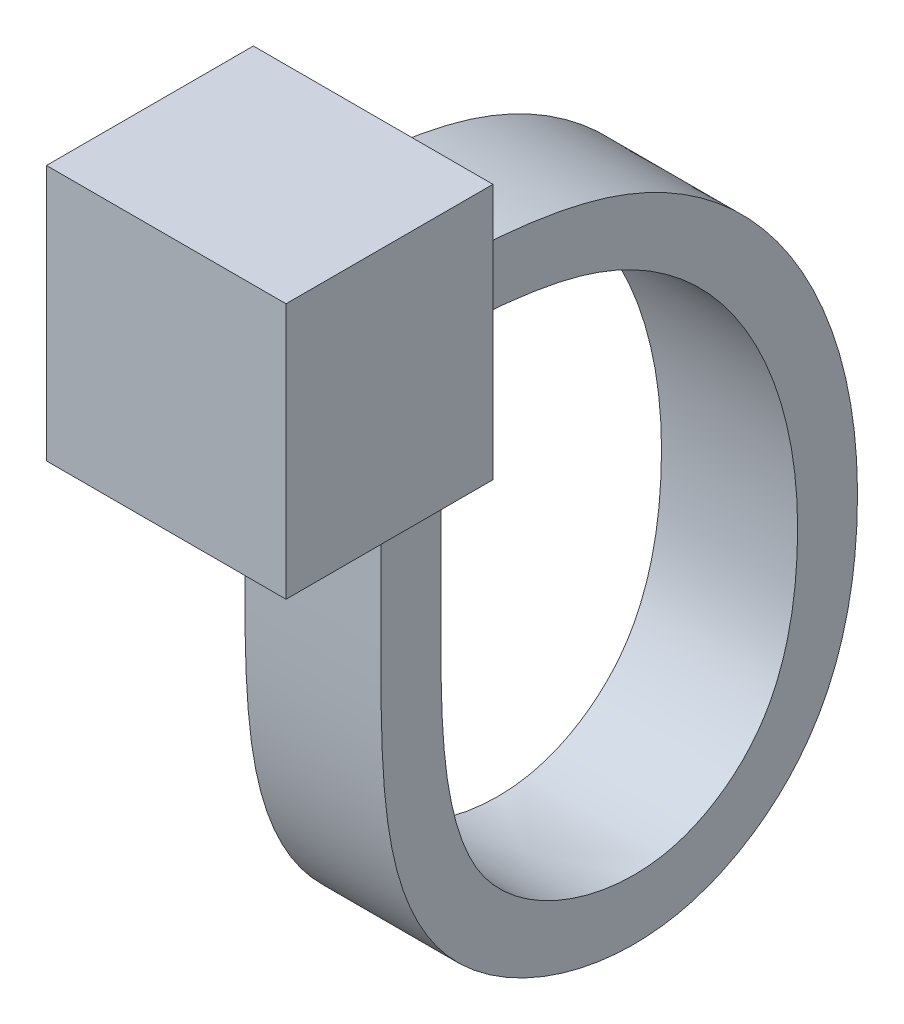
ISO-10303-21;
HEADER;
FILE_DESCRIPTION(('STEP AP214'),'2;1');
FILE_NAME('part.step','',(''),(''),'','','');
FILE_SCHEMA(('AUTOMOTIVE_DESIGN { 1 0 10303 214 1 1 1 1 }'));
ENDSEC;
DATA;
#1=APPLICATION_CONTEXT('core data for automotive mechanical design processes');
#2=APPLICATION_PROTOCOL_DEFINITION('international standard','automotive_design',2000,#1);
#3=PRODUCT_CONTEXT('',#1,'mechanical');
#4=PRODUCT('Part','Part','',(#3));
#5=PRODUCT_RELATED_PRODUCT_CATEGORY('part','',(#4));
#6=PRODUCT_DEFINITION_FORMATION('','',#4);
#7=PRODUCT_DEFINITION_CONTEXT('part definition',#1,'design');
#8=PRODUCT_DEFINITION('design','',#6,#7);
#9=PRODUCT_DEFINITION_SHAPE('','',#8);
#10=(LENGTH_UNIT() NAMED_UNIT(*) SI_UNIT(.MILLI.,.METRE.));
#11=(NAMED_UNIT(*) PLANE_ANGLE_UNIT() SI_UNIT($,.RADIAN.));
#12=(NAMED_UNIT(*) SI_UNIT($,.STERADIAN.) SOLID_ANGLE_UNIT());
#13=UNCERTAINTY_MEASURE_WITH_UNIT(LENGTH_MEASURE(1.E-05),#10,'distance_accuracy_value','');
#14=(GEOMETRIC_REPRESENTATION_CONTEXT(3) GLOBAL_UNCERTAINTY_ASSIGNED_CONTEXT((#13)) GLOBAL_UNIT_ASSIGNED_CONTEXT((#10,
#11,#12)) REPRESENTATION_CONTEXT('',''));
#15=CARTESIAN_POINT('',(0.,0.,0.));
#16=DIRECTION('',(0.,0.,1.));
#17=DIRECTION('',(1.,0.,0.));
#18=AXIS2_PLACEMENT_3D('',#15,#16,#17);
#19=CARTESIAN_POINT('',(0.,-4.7,3.8));
#20=DIRECTION('',(0.,1.,0.));
#21=DIRECTION('',(0.,0.,1.));
#22=AXIS2_PLACEMENT_3D('',#19,#20,#21);
#23=PLANE('',#22);
#24=DIRECTION('',(0.,0.,-1.));
#25=VECTOR('',#24,1.);
#26=CARTESIAN_POINT('',(0.95,-4.7,0.));
#27=LINE('',#26,#25);
#28=CARTESIAN_POINT('',(0.949999999999999,-4.7,1.1));
#29=VERTEX_POINT('',#28);
#30=CARTESIAN_POINT('',(0.95,-4.7,0.));
#31=VERTEX_POINT('',#30);
#32=EDGE_CURVE('E76',#29,#31,#27,.T.);
#33=ORIENTED_EDGE('',*,*,#32,.F.);
#34=DIRECTION('',(-1.,0.,0.));
#35=VECTOR('',#34,1.);
#36=CARTESIAN_POINT('',(0.949999999999999,-4.7,1.1));
#37=LINE('',#36,#35);
#38=CARTESIAN_POINT('',(3.45,-4.7,1.1));
#39=VERTEX_POINT('',#38);
#40=EDGE_CURVE('E71',#39,#29,#37,.T.);
#41=ORIENTED_EDGE('',*,*,#40,.F.);
#42=DIRECTION('',(0.,0.,1.));
#43=VECTOR('',#42,1.);
#44=CARTESIAN_POINT('',(3.45,-4.7,0.));
#45=LINE('',#44,#43);
#46=CARTESIAN_POINT('',(3.45,-4.7,0.));
#47=VERTEX_POINT('',#46);
#48=EDGE_CURVE('E133',#47,#39,#45,.T.);
#49=ORIENTED_EDGE('',*,*,#48,.F.);
#50=DIRECTION('',(1.,0.,0.));
#51=VECTOR('',#50,1.);
#52=CARTESIAN_POINT('',(0.,-4.7,0.));
#53=LINE('',#52,#51);
#54=CARTESIAN_POINT('',(4.4,-4.7,0.));
#55=VERTEX_POINT('',#54);
#56=EDGE_CURVE('E121',#47,#55,#53,.T.);
#57=ORIENTED_EDGE('',*,*,#56,.T.);
#58=DIRECTION('',(0.,0.,-1.));
#59=VECTOR('',#58,1.);
#60=CARTESIAN_POINT('',(4.4,-4.7,3.8));
#61=LINE('',#60,#59);
#62=CARTESIAN_POINT('',(4.4,-4.7,3.8));
#63=VERTEX_POINT('',#62);
#64=EDGE_CURVE('E63',#63,#55,#61,.T.);
#65=ORIENTED_EDGE('',*,*,#64,.F.);
#66=DIRECTION('',(1.,0.,0.));
#67=VECTOR('',#66,1.);
#68=CARTESIAN_POINT('',(0.,-4.7,3.8));
#69=LINE('',#68,#67);
#70=CARTESIAN_POINT('',(0.,-4.7,3.8));
#71=VERTEX_POINT('',#70);
#72=EDGE_CURVE('E194',#71,#63,#69,.T.);
#73=ORIENTED_EDGE('',*,*,#72,.F.);
#74=DIRECTION('',(0.,0.,-1.));
#75=VECTOR('',#74,1.);
#76=CARTESIAN_POINT('',(0.,-4.7,3.8));
#77=LINE('',#76,#75);
#78=CARTESIAN_POINT('',(0.,-4.7,0.));
#79=VERTEX_POINT('',#78);
#80=EDGE_CURVE('E12',#71,#79,#77,.T.);
#81=ORIENTED_EDGE('',*,*,#80,.T.);
#82=EDGE_CURVE('E130',#79,#31,#53,.T.);
#83=ORIENTED_EDGE('',*,*,#82,.T.);
#84=EDGE_LOOP('',(#33,#41,#49,#57,#65,#73,#81,#83));
#85=FACE_BOUND('',#84,.T.);
#86=ADVANCED_FACE('F52',(#85),#23,.F.);
#87=CARTESIAN_POINT('',(0.,0.,3.8));
#88=DIRECTION('',(1.,0.,0.));
#89=DIRECTION('',(0.,1.,0.));
#90=AXIS2_PLACEMENT_3D('',#87,#88,#89);
#91=PLANE('',#90);
#92=DIRECTION('',(0.,-1.,0.));
#93=VECTOR('',#92,1.);
#94=CARTESIAN_POINT('',(0.,0.,0.));
#95=LINE('',#94,#93);
#96=CARTESIAN_POINT('',(0.,0.,0.));
#97=VERTEX_POINT('',#96);
#98=EDGE_CURVE('E131',#97,#79,#95,.T.);
#99=ORIENTED_EDGE('',*,*,#98,.T.);
#100=ORIENTED_EDGE('',*,*,#80,.F.);
#101=DIRECTION('',(0.,-1.,0.));
#102=VECTOR('',#101,1.);
#103=CARTESIAN_POINT('',(0.,0.,3.8));
#104=LINE('',#103,#102);
#105=CARTESIAN_POINT('',(0.,0.,3.8));
#106=VERTEX_POINT('',#105);
#107=EDGE_CURVE('E181',#106,#71,#104,.T.);
#108=ORIENTED_EDGE('',*,*,#107,.F.);
#109=DIRECTION('',(0.,0.,-1.));
#110=VECTOR('',#109,1.);
#111=CARTESIAN_POINT('',(0.,0.,3.8));
#112=LINE('',#111,#110);
#113=EDGE_CURVE('E182',#106,#97,#112,.T.);
#114=ORIENTED_EDGE('',*,*,#113,.T.);
#115=EDGE_LOOP('',(#99,#100,#108,#114));
#116=FACE_BOUND('',#115,.T.);
#117=ADVANCED_FACE('F54',(#116),#91,.F.);
#118=CARTESIAN_POINT('',(4.4,0.,3.8));
#119=DIRECTION('',(-1.,0.,0.));
#120=DIRECTION('',(0.,0.,1.));
#121=AXIS2_PLACEMENT_3D('',#118,#119,#120);
#122=PLANE('',#121);
#123=DIRECTION('',(0.,1.,0.));
#124=VECTOR('',#123,1.);
#125=CARTESIAN_POINT('',(4.4,0.,0.));
#126=LINE('',#125,#124);
#127=CARTESIAN_POINT('',(4.4,0.,0.));
#128=VERTEX_POINT('',#127);
#129=EDGE_CURVE('E127',#55,#128,#126,.T.);
#130=ORIENTED_EDGE('',*,*,#129,.T.);
#131=DIRECTION('',(0.,0.,-1.));
#132=VECTOR('',#131,1.);
#133=CARTESIAN_POINT('',(4.4,0.,3.8));
#134=LINE('',#133,#132);
#135=CARTESIAN_POINT('',(4.4,0.,3.8));
#136=VERTEX_POINT('',#135);
#137=EDGE_CURVE('E185',#136,#128,#134,.T.);
#138=ORIENTED_EDGE('',*,*,#137,.F.);
#139=DIRECTION('',(0.,1.,0.));
#140=VECTOR('',#139,1.);
#141=CARTESIAN_POINT('',(4.4,0.,3.8));
#142=LINE('',#141,#140);
#143=EDGE_CURVE('E193',#63,#136,#142,.T.);
#144=ORIENTED_EDGE('',*,*,#143,.F.);
#145=ORIENTED_EDGE('',*,*,#64,.T.);
#146=EDGE_LOOP('',(#130,#138,#144,#145));
#147=FACE_BOUND('',#146,.T.);
#148=ADVANCED_FACE('F191',(#147),#122,.F.);
#149=CARTESIAN_POINT('',(0.,0.,3.8));
#150=DIRECTION('',(0.,-1.,0.));
#151=DIRECTION('',(0.,0.,-1.));
#152=AXIS2_PLACEMENT_3D('',#149,#150,#151);
#153=PLANE('',#152);
#154=DIRECTION('',(-1.,0.,0.));
#155=VECTOR('',#154,1.);
#156=CARTESIAN_POINT('',(0.,0.,0.));
#157=LINE('',#156,#155);
#158=EDGE_CURVE('E179',#128,#97,#157,.T.);
#159=ORIENTED_EDGE('',*,*,#158,.T.);
#160=ORIENTED_EDGE('',*,*,#113,.F.);
#161=DIRECTION('',(-1.,0.,0.));
#162=VECTOR('',#161,1.);
#163=CARTESIAN_POINT('',(0.,0.,3.8));
#164=LINE('',#163,#162);
#165=EDGE_CURVE('E186',#136,#106,#164,.T.);
#166=ORIENTED_EDGE('',*,*,#165,.F.);
#167=ORIENTED_EDGE('',*,*,#137,.T.);
#168=EDGE_LOOP('',(#159,#160,#166,#167));
#169=FACE_BOUND('',#168,.T.);
#170=ADVANCED_FACE('F221',(#169),#153,.F.);
#171=CARTESIAN_POINT('',(0.,0.,3.8));
#172=DIRECTION('',(0.,0.,1.));
#173=DIRECTION('',(1.,0.,0.));
#174=AXIS2_PLACEMENT_3D('',#171,#172,#173);
#175=PLANE('',#174);
#176=ORIENTED_EDGE('',*,*,#107,.T.);
#177=ORIENTED_EDGE('',*,*,#72,.T.);
#178=ORIENTED_EDGE('',*,*,#143,.T.);
#179=ORIENTED_EDGE('',*,*,#165,.T.);
#180=EDGE_LOOP('',(#176,#177,#178,#179));
#181=FACE_BOUND('',#180,.T.);
#182=ADVANCED_FACE('F201',(#181),#175,.T.);
#183=CARTESIAN_POINT('',(0.,0.,0.));
#184=DIRECTION('',(0.,0.,1.));
#185=DIRECTION('',(1.,0.,0.));
#186=AXIS2_PLACEMENT_3D('',#183,#184,#185);
#187=PLANE('',#186);
#188=DIRECTION('',(1.,0.,0.));
#189=VECTOR('',#188,1.);
#190=CARTESIAN_POINT('',(0.949999999999999,-2.9,0.));
#191=LINE('',#190,#189);
#192=CARTESIAN_POINT('',(0.949999999999999,-2.9,0.));
#193=VERTEX_POINT('',#192);
#194=CARTESIAN_POINT('',(3.45,-2.9,0.));
#195=VERTEX_POINT('',#194);
#196=EDGE_CURVE('E214',#193,#195,#191,.T.);
#197=ORIENTED_EDGE('',*,*,#196,.T.);
#198=DIRECTION('',(0.,1.,0.));
#199=VECTOR('',#198,1.);
#200=CARTESIAN_POINT('',(3.45,-2.9,0.));
#201=LINE('',#200,#199);
#202=CARTESIAN_POINT('',(3.45,-1.8,0.));
#203=VERTEX_POINT('',#202);
#204=EDGE_CURVE('E149',#195,#203,#201,.T.);
#205=ORIENTED_EDGE('',*,*,#204,.T.);
#206=DIRECTION('',(-1.,0.,0.));
#207=VECTOR('',#206,1.);
#208=CARTESIAN_POINT('',(0.949999999999998,-1.8,0.));
#209=LINE('',#208,#207);
#210=CARTESIAN_POINT('',(0.949999999999998,-1.8,0.));
#211=VERTEX_POINT('',#210);
#212=EDGE_CURVE('E154',#203,#211,#209,.T.);
#213=ORIENTED_EDGE('',*,*,#212,.T.);
#214=DIRECTION('',(0.,-1.,0.));
#215=VECTOR('',#214,1.);
#216=CARTESIAN_POINT('',(0.949999999999999,-2.9,0.));
#217=LINE('',#216,#215);
#218=EDGE_CURVE('E216',#211,#193,#217,.T.);
#219=ORIENTED_EDGE('',*,*,#218,.T.);
#220=EDGE_LOOP('',(#197,#205,#213,#219));
#221=FACE_BOUND('',#220,.T.);
#222=ORIENTED_EDGE('',*,*,#98,.F.);
#223=ORIENTED_EDGE('',*,*,#158,.F.);
#224=ORIENTED_EDGE('',*,*,#129,.F.);
#225=ORIENTED_EDGE('',*,*,#56,.F.);
#226=DIRECTION('',(1.,0.,0.));
#227=VECTOR('',#226,1.);
#228=CARTESIAN_POINT('',(0.95,-4.7,0.));
#229=LINE('',#228,#227);
#230=EDGE_CURVE('E125',#31,#47,#229,.T.);
#231=ORIENTED_EDGE('',*,*,#230,.F.);
#232=ORIENTED_EDGE('',*,*,#82,.F.);
#233=EDGE_LOOP('',(#222,#223,#224,#225,#231,#232));
#234=FACE_BOUND('',#233,.T.);
#235=ADVANCED_FACE('F123',(#221,#234),#187,.F.);
#236=CARTESIAN_POINT('',(3.45,-4.7,1.1));
#237=CARTESIAN_POINT('',(3.45000000000003,-5.00075897761313,1.10002399837554));
#238=CARTESIAN_POINT('',(3.45000000000009,-5.96869769823307,1.0971515183996));
#239=CARTESIAN_POINT('',(3.45000000000013,-7.23020923670657,1.10845475249697));
#240=CARTESIAN_POINT('',(3.45000000000006,-8.30048718037345,1.10892889754338));
#241=CARTESIAN_POINT('',(3.44999999999996,-9.97453453234742,1.04961274628848));
#242=CARTESIAN_POINT('',(3.45,-11.5047372696232,0.781597560347517));
#243=CARTESIAN_POINT('',(3.45,-12.5754445948594,0.084936975252066));
#244=CARTESIAN_POINT('',(3.45,-13.1057994503958,-0.375357221664349));
#245=CARTESIAN_POINT('',(3.45,-13.6185803681067,-1.00518007352417));
#246=CARTESIAN_POINT('',(3.45,-14.052581858648,-1.89061251984621));
#247=CARTESIAN_POINT('',(3.45,-14.2856118299163,-2.75767231438514));
#248=CARTESIAN_POINT('',(3.45,-14.3581860670794,-3.56196537408449));
#249=CARTESIAN_POINT('',(3.45,-14.302352892956,-4.11314866336894));
#250=CARTESIAN_POINT('',(3.45,-14.1879268619077,-4.63886598446562));
#251=CARTESIAN_POINT('',(3.45,-14.0162164997758,-5.15111551309885));
#252=CARTESIAN_POINT('',(3.45,-13.6243418362757,-5.83138617734611));
#253=CARTESIAN_POINT('',(3.45,-13.1835152970487,-6.33766569160545));
#254=CARTESIAN_POINT('',(3.45,-12.78231517196,-6.67506255929699));
#255=CARTESIAN_POINT('',(3.45,-12.2470069054594,-7.03965717642979));
#256=CARTESIAN_POINT('',(3.45,-11.4395519345468,-7.38805207875104));
#257=CARTESIAN_POINT('',(3.45,-10.4815392111754,-7.5784361719321));
#258=CARTESIAN_POINT('',(3.45,-9.6218900574342,-7.64859270164172));
#259=CARTESIAN_POINT('',(3.45,-8.65176428411466,-7.65164413281618));
#260=CARTESIAN_POINT('',(3.45,-7.42520247287616,-7.50483833107229));
#261=CARTESIAN_POINT('',(3.45,-6.33435527736652,-7.17842563852216));
#262=CARTESIAN_POINT('',(3.45,-5.45786310662321,-6.78949557154519));
#263=CARTESIAN_POINT('',(3.45,-4.61728939986536,-6.31587220959409));
#264=CARTESIAN_POINT('',(3.45,-3.61686578845368,-5.50507270453413));
#265=CARTESIAN_POINT('',(3.45,-2.77300329075352,-4.40668693170029));
#266=CARTESIAN_POINT('',(3.45,-2.34268445895287,-3.46798376409724));
#267=CARTESIAN_POINT('',(3.45,-2.0987271408728,-2.68990542084422));
#268=CARTESIAN_POINT('',(3.45,-1.92412324076992,-1.86998585047193));
#269=CARTESIAN_POINT('',(3.45,-1.81495898113651,-0.811189651360613));
#270=CARTESIAN_POINT('',(3.45,-1.80026624753439,-0.215359682506719));
#271=CARTESIAN_POINT('',(3.45,-1.8,0.));
#272=CARTESIAN_POINT('',(0.949999999999999,-4.7,1.1));
#273=CARTESIAN_POINT('',(0.950000000000033,-5.00075897761313,1.1000239983757));
#274=CARTESIAN_POINT('',(0.950000000000093,-5.96869769823307,1.09715151840003));
#275=CARTESIAN_POINT('',(0.950000000000126,-7.23020923670657,1.10845475249754));
#276=CARTESIAN_POINT('',(0.950000000000059,-8.30048718037345,1.10892889754366));
#277=CARTESIAN_POINT('',(0.949999999999962,-9.97453453234742,1.04961274628831));
#278=CARTESIAN_POINT('',(0.950000000000001,-11.5047372696232,0.781597560347524));
#279=CARTESIAN_POINT('',(0.95,-12.5754445948594,0.0849369752520677));
#280=CARTESIAN_POINT('',(0.949999999999999,-13.1057994503958,-0.375357221664352));
#281=CARTESIAN_POINT('',(0.949999999999999,-13.6185803681067,-1.00518007352417));
#282=CARTESIAN_POINT('',(0.95,-14.052581858648,-1.89061251984621));
#283=CARTESIAN_POINT('',(0.949999999999999,-14.2856118299163,-2.75767231438514));
#284=CARTESIAN_POINT('',(0.949999999999998,-14.3581860670794,-3.56196537408449));
#285=CARTESIAN_POINT('',(0.949999999999999,-14.302352892956,-4.11314866336894));
#286=CARTESIAN_POINT('',(0.95,-14.1879268619077,-4.63886598446562));
#287=CARTESIAN_POINT('',(0.95,-14.0162164997758,-5.15111551309885));
#288=CARTESIAN_POINT('',(0.950000000000001,-13.6243418362757,-5.83138617734611));
#289=CARTESIAN_POINT('',(0.95,-13.1835152970487,-6.33766569160545));
#290=CARTESIAN_POINT('',(0.95,-12.78231517196,-6.67506255929699));
#291=CARTESIAN_POINT('',(0.950000000000001,-12.2470069054594,-7.0396571764298));
#292=CARTESIAN_POINT('',(0.95,-11.4395519345468,-7.38805207875104));
#293=CARTESIAN_POINT('',(0.949999999999999,-10.4815392111754,-7.5784361719321));
#294=CARTESIAN_POINT('',(0.949999999999998,-9.6218900574342,-7.64859270164171));
#295=CARTESIAN_POINT('',(0.949999999999998,-8.65176428411466,-7.65164413281617));
#296=CARTESIAN_POINT('',(0.95,-7.42520247287615,-7.50483833107229));
#297=CARTESIAN_POINT('',(0.949999999999999,-6.33435527736652,-7.17842563852216));
#298=CARTESIAN_POINT('',(0.949999999999999,-5.45786310662321,-6.78949557154519));
#299=CARTESIAN_POINT('',(0.949999999999999,-4.61728939986536,-6.3158722095941));
#300=CARTESIAN_POINT('',(0.95,-3.61686578845367,-5.50507270453413));
#301=CARTESIAN_POINT('',(0.949999999999998,-2.77300329075352,-4.40668693170029));
#302=CARTESIAN_POINT('',(0.949999999999999,-2.34268445895287,-3.46798376409724));
#303=CARTESIAN_POINT('',(0.949999999999999,-2.0987271408728,-2.68990542084422));
#304=CARTESIAN_POINT('',(0.949999999999999,-1.92412324076992,-1.86998585047193));
#305=CARTESIAN_POINT('',(0.949999999999999,-1.81495898113651,-0.811189651360613));
#306=CARTESIAN_POINT('',(0.949999999999999,-1.80026624753439,-0.215359682506719));
#307=CARTESIAN_POINT('',(0.949999999999999,-1.8,0.));
#308=B_SPLINE_SURFACE_WITH_KNOTS('',1,3,((#236,#237,#238,#239,#240,#241,#242,#243,#244,#245,
#246,#247,#248,#249,#250,#251,#252,#253,#254,#255,#256,#257,#258,#259,#260,#261,#262,#263,#264,
#265,#266,#267,#268,#269,#270,#271),(#272,#273,#274,#275,#276,#277,#278,#279,#280,#281,#282,
#283,#284,#285,#286,#287,#288,#289,#290,#291,#292,#293,#294,#295,#296,#297,#298,#299,#300,#301,
#302,#303,#304,#305,#306,#307)),.UNSPECIFIED.,.F.,.F.,.F.,(2,2),(4,1,1,1,1,1,1,1,1,1,1,1,1,1,1,
1,1,1,1,1,1,1,1,1,1,1,1,1,1,1,1,1,1,4),(0.652777777777778,1.),(0.,0.047683783453268,
0.0833333333333333,0.130150734730237,0.166666666666667,0.249999999999971,0.272449765139392,
0.281250000000033,0.312500000000061,0.34375,0.367187499999906,0.390625,0.414062499999999,
0.415114365561154,0.437499999999699,0.4609375,0.484375,0.497245753590653,0.507812499999999,
0.54296875,0.578125,0.599081823477724,0.624999999999999,0.671875,0.718749999999997,
0.73613820356829,0.765625,0.812500000000002,0.859375,0.89453125,0.904141726257143,0.9296875,
0.96484375,1.),.UNSPECIFIED.);
#309=CARTESIAN_POINT('',(0.949999999999999,-4.7,1.1));
#310=CARTESIAN_POINT('',(0.950000000000033,-5.00075897761313,1.1000239983757));
#311=CARTESIAN_POINT('',(0.950000000000093,-5.96869769823307,1.09715151840003));
#312=CARTESIAN_POINT('',(0.950000000000126,-7.23020923670657,1.10845475249754));
#313=CARTESIAN_POINT('',(0.950000000000059,-8.30048718037345,1.10892889754366));
#314=CARTESIAN_POINT('',(0.949999999999962,-9.97453453234742,1.04961274628831));
#315=CARTESIAN_POINT('',(0.950000000000001,-11.5047372696232,0.781597560347524));
#316=CARTESIAN_POINT('',(0.95,-12.5754445948594,0.0849369752520677));
#317=CARTESIAN_POINT('',(0.949999999999999,-13.1057994503958,-0.375357221664352));
#318=CARTESIAN_POINT('',(0.949999999999999,-13.6185803681067,-1.00518007352417));
#319=CARTESIAN_POINT('',(0.95,-14.052581858648,-1.89061251984621));
#320=CARTESIAN_POINT('',(0.949999999999999,-14.2856118299163,-2.75767231438514));
#321=CARTESIAN_POINT('',(0.949999999999998,-14.3581860670794,-3.56196537408449));
#322=CARTESIAN_POINT('',(0.949999999999999,-14.302352892956,-4.11314866336894));
#323=CARTESIAN_POINT('',(0.95,-14.1879268619077,-4.63886598446562));
#324=CARTESIAN_POINT('',(0.95,-14.0162164997758,-5.15111551309885));
#325=CARTESIAN_POINT('',(0.950000000000001,-13.6243418362757,-5.83138617734611));
#326=CARTESIAN_POINT('',(0.95,-13.1835152970487,-6.33766569160545));
#327=CARTESIAN_POINT('',(0.95,-12.78231517196,-6.67506255929699));
#328=CARTESIAN_POINT('',(0.950000000000001,-12.2470069054594,-7.0396571764298));
#329=CARTESIAN_POINT('',(0.95,-11.4395519345468,-7.38805207875104));
#330=CARTESIAN_POINT('',(0.949999999999999,-10.4815392111754,-7.5784361719321));
#331=CARTESIAN_POINT('',(0.949999999999998,-9.6218900574342,-7.64859270164171));
#332=CARTESIAN_POINT('',(0.949999999999998,-8.65176428411466,-7.65164413281617));
#333=CARTESIAN_POINT('',(0.95,-7.42520247287615,-7.50483833107229));
#334=CARTESIAN_POINT('',(0.949999999999999,-6.33435527736652,-7.17842563852216));
#335=CARTESIAN_POINT('',(0.949999999999999,-5.45786310662321,-6.78949557154519));
#336=CARTESIAN_POINT('',(0.949999999999999,-4.61728939986536,-6.3158722095941));
#337=CARTESIAN_POINT('',(0.95,-3.61686578845367,-5.50507270453413));
#338=CARTESIAN_POINT('',(0.949999999999998,-2.77300329075352,-4.40668693170029));
#339=CARTESIAN_POINT('',(0.949999999999999,-2.34268445895287,-3.46798376409724));
#340=CARTESIAN_POINT('',(0.949999999999999,-2.0987271408728,-2.68990542084422));
#341=CARTESIAN_POINT('',(0.949999999999999,-1.92412324076992,-1.86998585047193));
#342=CARTESIAN_POINT('',(0.949999999999999,-1.81495898113651,-0.811189651360613));
#343=CARTESIAN_POINT('',(0.949999999999999,-1.80026624753439,-0.215359682506719));
#344=CARTESIAN_POINT('',(0.949999999999999,-1.8,0.));
#345=B_SPLINE_CURVE_WITH_KNOTS('',3,(#309,#310,#311,#312,#313,#314,#315,#316,#317,#318,#319,
#320,#321,#322,#323,#324,#325,#326,#327,#328,#329,#330,#331,#332,#333,#334,#335,#336,#337,#338,
#339,#340,#341,#342,#343,#344),.UNSPECIFIED.,.F.,.F.,(4,1,1,1,1,1,1,1,1,1,1,1,1,1,1,1,1,1,1,1,1,
1,1,1,1,1,1,1,1,1,1,1,1,4),(0.,0.047683783453268,0.0833333333333333,0.130150734730237,
0.166666666666667,0.249999999999971,0.272449765139392,0.281250000000033,0.312500000000061,
0.34375,0.367187499999906,0.390625,0.414062499999999,0.415114365561154,0.437499999999699,
0.4609375,0.484375,0.497245753590653,0.507812499999999,0.54296875,0.578125,0.599081823477724,
0.624999999999999,0.671875,0.718749999999997,0.73613820356829,0.765625,0.812500000000002,
0.859375,0.89453125,0.904141726257143,0.9296875,0.96484375,1.),.UNSPECIFIED.);
#346=EDGE_CURVE('E152',#29,#211,#345,.T.);
#347=CARTESIAN_POINT('',(3.45,-4.7,1.1));
#348=CARTESIAN_POINT('',(3.45000000000003,-5.00075897761313,1.10002399837554));
#349=CARTESIAN_POINT('',(3.45000000000009,-5.96869769823307,1.0971515183996));
#350=CARTESIAN_POINT('',(3.45000000000013,-7.23020923670657,1.10845475249697));
#351=CARTESIAN_POINT('',(3.45000000000006,-8.30048718037345,1.10892889754338));
#352=CARTESIAN_POINT('',(3.44999999999996,-9.97453453234742,1.04961274628848));
#353=CARTESIAN_POINT('',(3.45,-11.5047372696232,0.781597560347517));
#354=CARTESIAN_POINT('',(3.45,-12.5754445948594,0.084936975252066));
#355=CARTESIAN_POINT('',(3.45,-13.1057994503958,-0.375357221664349));
#356=CARTESIAN_POINT('',(3.45,-13.6185803681067,-1.00518007352417));
#357=CARTESIAN_POINT('',(3.45,-14.052581858648,-1.89061251984621));
#358=CARTESIAN_POINT('',(3.45,-14.2856118299163,-2.75767231438514));
#359=CARTESIAN_POINT('',(3.45,-14.3581860670794,-3.56196537408449));
#360=CARTESIAN_POINT('',(3.45,-14.302352892956,-4.11314866336894));
#361=CARTESIAN_POINT('',(3.45,-14.1879268619077,-4.63886598446562));
#362=CARTESIAN_POINT('',(3.45,-14.0162164997758,-5.15111551309885));
#363=CARTESIAN_POINT('',(3.45,-13.6243418362757,-5.83138617734611));
#364=CARTESIAN_POINT('',(3.45,-13.1835152970487,-6.33766569160545));
#365=CARTESIAN_POINT('',(3.45,-12.78231517196,-6.67506255929699));
#366=CARTESIAN_POINT('',(3.45,-12.2470069054594,-7.03965717642979));
#367=CARTESIAN_POINT('',(3.45,-11.4395519345468,-7.38805207875104));
#368=CARTESIAN_POINT('',(3.45,-10.4815392111754,-7.5784361719321));
#369=CARTESIAN_POINT('',(3.45,-9.6218900574342,-7.64859270164172));
#370=CARTESIAN_POINT('',(3.45,-8.65176428411466,-7.65164413281618));
#371=CARTESIAN_POINT('',(3.45,-7.42520247287616,-7.50483833107229));
#372=CARTESIAN_POINT('',(3.45,-6.33435527736652,-7.17842563852216));
#373=CARTESIAN_POINT('',(3.45,-5.45786310662321,-6.78949557154519));
#374=CARTESIAN_POINT('',(3.45,-4.61728939986536,-6.31587220959409));
#375=CARTESIAN_POINT('',(3.45,-3.61686578845368,-5.50507270453413));
#376=CARTESIAN_POINT('',(3.45,-2.77300329075352,-4.40668693170029));
#377=CARTESIAN_POINT('',(3.45,-2.34268445895287,-3.46798376409724));
#378=CARTESIAN_POINT('',(3.45,-2.0987271408728,-2.68990542084422));
#379=CARTESIAN_POINT('',(3.45,-1.92412324076992,-1.86998585047193));
#380=CARTESIAN_POINT('',(3.45,-1.81495898113651,-0.811189651360613));
#381=CARTESIAN_POINT('',(3.45,-1.80026624753439,-0.215359682506719));
#382=CARTESIAN_POINT('',(3.45,-1.8,0.));
#383=B_SPLINE_CURVE_WITH_KNOTS('',3,(#347,#348,#349,#350,#351,#352,#353,#354,#355,#356,#357,
#358,#359,#360,#361,#362,#363,#364,#365,#366,#367,#368,#369,#370,#371,#372,#373,#374,#375,#376,
#377,#378,#379,#380,#381,#382),.UNSPECIFIED.,.F.,.F.,(4,1,1,1,1,1,1,1,1,1,1,1,1,1,1,1,1,1,1,1,1,
1,1,1,1,1,1,1,1,1,1,1,1,4),(0.,0.047683783453268,0.0833333333333333,0.130150734730237,
0.166666666666667,0.249999999999971,0.272449765139392,0.281250000000033,0.312500000000061,
0.34375,0.367187499999906,0.390625,0.414062499999999,0.415114365561154,0.437499999999699,
0.4609375,0.484375,0.497245753590653,0.507812499999999,0.54296875,0.578125,0.599081823477724,
0.624999999999999,0.671875,0.718749999999997,0.73613820356829,0.765625,0.812500000000002,
0.859375,0.89453125,0.904141726257143,0.9296875,0.96484375,1.),.UNSPECIFIED.);
#384=EDGE_CURVE('E150',#39,#203,#383,.T.);
#385=ORIENTED_EDGE('',*,*,#40,.T.);
#386=ORIENTED_EDGE('',*,*,#346,.T.);
#387=ORIENTED_EDGE('',*,*,#212,.F.);
#388=ORIENTED_EDGE('',*,*,#384,.F.);
#389=EDGE_LOOP('',(#385,#386,#387,#388));
#390=FACE_BOUND('',#389,.T.);
#391=ADVANCED_FACE('F208',(#390),#308,.T.);
#392=CARTESIAN_POINT('',(3.45,-4.7,0.));
#393=DIRECTION('',(-1.,0.,0.));
#394=DIRECTION('',(0.,0.,1.));
#395=AXIS2_PLACEMENT_3D('',#392,#393,#394);
#396=PLANE('',#395);
#397=ORIENTED_EDGE('',*,*,#48,.T.);
#398=ORIENTED_EDGE('',*,*,#384,.T.);
#399=ORIENTED_EDGE('',*,*,#204,.F.);
#400=CARTESIAN_POINT('',(3.45,-4.7,0.));
#401=CARTESIAN_POINT('',(3.44999999999997,-5.00371708361184,-2.39983756997735E-05));
#402=CARTESIAN_POINT('',(3.44999999999991,-5.97682546182548,-0.00298035863505745));
#403=CARTESIAN_POINT('',(3.44999999999987,-7.23802309509996,0.00843198587098936));
#404=CARTESIAN_POINT('',(3.44999999999994,-8.29475229918748,0.00938551460097798));
#405=CARTESIAN_POINT('',(3.45000000000004,-9.86897106474004,-0.0461319423548413));
#406=CARTESIAN_POINT('',(3.45,-11.1552089375284,-0.304583521494917));
#407=CARTESIAN_POINT('',(3.45,-11.9174771340715,-0.798530011373343));
#408=CARTESIAN_POINT('',(3.45,-12.2966399169901,-1.13126113544755));
#409=CARTESIAN_POINT('',(3.45,-12.6819776007307,-1.59898780711504));
#410=CARTESIAN_POINT('',(3.45,-13.0183476847866,-2.28500680401885));
#411=CARTESIAN_POINT('',(3.45,-13.1977575172537,-2.95345897413142));
#412=CARTESIAN_POINT('',(3.45,-13.2513640088374,-3.56106257253854));
#413=CARTESIAN_POINT('',(3.45,-13.2105720385298,-3.95685449960383));
#414=CARTESIAN_POINT('',(3.45,-13.12918909249,-4.33115313665135));
#415=CARTESIAN_POINT('',(3.45,-13.0077942916383,-4.69308209244085));
#416=CARTESIAN_POINT('',(3.45,-12.7234308026414,-5.18884590957275));
#417=CARTESIAN_POINT('',(3.45,-12.4013781265012,-5.55715824153929));
#418=CARTESIAN_POINT('',(3.45,-12.1162193194313,-5.79792909534773));
#419=CARTESIAN_POINT('',(3.45,-11.7321469959691,-6.05869314274761));
#420=CARTESIAN_POINT('',(3.45,-11.1230051884452,-6.3261648009876));
#421=CARTESIAN_POINT('',(3.45,-10.3296741063919,-6.48704639150029));
#422=CARTESIAN_POINT('',(3.45,-9.57974262803585,-6.5473903809955));
#423=CARTESIAN_POINT('',(3.45,-8.71860605297593,-6.55156351395616));
#424=CARTESIAN_POINT('',(3.45,-7.6480694431003,-6.42178970781994));
#425=CARTESIAN_POINT('',(3.45,-6.705980213146,-6.1397924783141));
#426=CARTESIAN_POINT('',(3.45,-5.95577076173354,-5.80662018218865));
#427=CARTESIAN_POINT('',(3.45,-5.24210123453056,-5.40426075798576));
#428=CARTESIAN_POINT('',(3.45,-4.40996819549604,-4.72820348249885));
#429=CARTESIAN_POINT('',(3.45,-3.72037560756799,-3.82876871581913));
#430=CARTESIAN_POINT('',(3.45,-3.36935040447964,-3.06448508022742));
#431=CARTESIAN_POINT('',(3.45,-3.16520500109808,-2.41524420902399));
#432=CARTESIAN_POINT('',(3.45,-3.01533388233558,-1.71256074656143));
#433=CARTESIAN_POINT('',(3.45,-2.91336149593016,-0.738198337387301));
#434=CARTESIAN_POINT('',(3.45,-2.89973375246561,-0.191029244515615));
#435=CARTESIAN_POINT('',(3.45,-2.9,0.));
#436=B_SPLINE_CURVE_WITH_KNOTS('',3,(#400,#401,#402,#403,#404,#405,#406,#407,#408,#409,#410,
#411,#412,#413,#414,#415,#416,#417,#418,#419,#420,#421,#422,#423,#424,#425,#426,#427,#428,#429,
#430,#431,#432,#433,#434,#435),.UNSPECIFIED.,.F.,.F.,(4,1,1,1,1,1,1,1,1,1,1,1,1,1,1,1,1,1,1,1,1,
1,1,1,1,1,1,1,1,1,1,1,1,4),(0.,0.047683783453268,0.0833333333333333,0.130150734730237,
0.166666666666667,0.249999999999971,0.272449765139392,0.281250000000033,0.312500000000061,
0.34375,0.367187499999906,0.390625,0.414062499999999,0.415114365561154,0.437499999999699,
0.4609375,0.484375,0.497245753590653,0.507812499999999,0.54296875,0.578125,0.599081823477724,
0.624999999999999,0.671875,0.718749999999997,0.73613820356829,0.765625,0.812500000000002,
0.859375,0.89453125,0.904141726257143,0.9296875,0.96484375,1.),.UNSPECIFIED.);
#437=EDGE_CURVE('E143',#47,#195,#436,.T.);
#438=ORIENTED_EDGE('',*,*,#437,.F.);
#439=EDGE_LOOP('',(#397,#398,#399,#438));
#440=FACE_BOUND('',#439,.T.);
#441=ADVANCED_FACE('F147',(#440),#396,.F.);
#442=CARTESIAN_POINT('',(0.95,-4.7,0.));
#443=CARTESIAN_POINT('',(0.949999999999966,-5.00371708361184,-2.39983755443307E-05));
#444=CARTESIAN_POINT('',(0.949999999999906,-5.97682546182548,-0.00298035863463035));
#445=CARTESIAN_POINT('',(0.949999999999874,-7.23802309509996,0.00843198587156381));
#446=CARTESIAN_POINT('',(0.949999999999941,-8.29475229918748,0.0093855146012493));
#447=CARTESIAN_POINT('',(0.950000000000038,-9.86897106474003,-0.0461319423550123));
#448=CARTESIAN_POINT('',(0.949999999999999,-11.1552089375284,-0.30458352149491));
#449=CARTESIAN_POINT('',(0.950000000000001,-11.9174771340715,-0.798530011373341));
#450=CARTESIAN_POINT('',(0.950000000000002,-12.2966399169901,-1.13126113544756));
#451=CARTESIAN_POINT('',(0.950000000000001,-12.6819776007307,-1.59898780711504));
#452=CARTESIAN_POINT('',(0.95,-13.0183476847866,-2.28500680401885));
#453=CARTESIAN_POINT('',(0.95,-13.1977575172537,-2.95345897413142));
#454=CARTESIAN_POINT('',(0.949999999999999,-13.2513640088374,-3.56106257253854));
#455=CARTESIAN_POINT('',(0.95,-13.2105720385298,-3.95685449960383));
#456=CARTESIAN_POINT('',(0.95,-13.12918909249,-4.33115313665135));
#457=CARTESIAN_POINT('',(0.950000000000001,-13.0077942916383,-4.69308209244085));
#458=CARTESIAN_POINT('',(0.950000000000002,-12.7234308026414,-5.18884590957275));
#459=CARTESIAN_POINT('',(0.950000000000001,-12.4013781265012,-5.55715824153929));
#460=CARTESIAN_POINT('',(0.95,-12.1162193194313,-5.79792909534773));
#461=CARTESIAN_POINT('',(0.949999999999998,-11.7321469959691,-6.05869314274762));
#462=CARTESIAN_POINT('',(0.950000000000002,-11.1230051884452,-6.3261648009876));
#463=CARTESIAN_POINT('',(0.950000000000001,-10.3296741063919,-6.48704639150029));
#464=CARTESIAN_POINT('',(0.950000000000001,-9.57974262803585,-6.54739038099549));
#465=CARTESIAN_POINT('',(0.950000000000003,-8.71860605297593,-6.55156351395615));
#466=CARTESIAN_POINT('',(0.95,-7.6480694431003,-6.42178970781994));
#467=CARTESIAN_POINT('',(0.95,-6.705980213146,-6.1397924783141));
#468=CARTESIAN_POINT('',(0.95,-5.95577076173354,-5.80662018218866));
#469=CARTESIAN_POINT('',(0.949999999999999,-5.24210123453056,-5.40426075798576));
#470=CARTESIAN_POINT('',(0.949999999999999,-4.40996819549604,-4.72820348249885));
#471=CARTESIAN_POINT('',(0.95,-3.72037560756799,-3.82876871581913));
#472=CARTESIAN_POINT('',(0.95,-3.36935040447965,-3.06448508022742));
#473=CARTESIAN_POINT('',(0.95,-3.16520500109808,-2.41524420902399));
#474=CARTESIAN_POINT('',(0.95,-3.01533388233558,-1.71256074656143));
#475=CARTESIAN_POINT('',(0.949999999999999,-2.91336149593016,-0.738198337387301));
#476=CARTESIAN_POINT('',(0.95,-2.89973375246561,-0.191029244515616));
#477=CARTESIAN_POINT('',(0.95,-2.9,0.));
#478=CARTESIAN_POINT('',(3.45,-4.7,0.));
#479=CARTESIAN_POINT('',(3.44999999999997,-5.00371708361184,-2.39983756997735E-05));
#480=CARTESIAN_POINT('',(3.44999999999991,-5.97682546182548,-0.00298035863505745));
#481=CARTESIAN_POINT('',(3.44999999999987,-7.23802309509996,0.00843198587098936));
#482=CARTESIAN_POINT('',(3.44999999999994,-8.29475229918748,0.00938551460097798));
#483=CARTESIAN_POINT('',(3.45000000000004,-9.86897106474004,-0.0461319423548413));
#484=CARTESIAN_POINT('',(3.45,-11.1552089375284,-0.304583521494917));
#485=CARTESIAN_POINT('',(3.45,-11.9174771340715,-0.798530011373343));
#486=CARTESIAN_POINT('',(3.45,-12.2966399169901,-1.13126113544755));
#487=CARTESIAN_POINT('',(3.45,-12.6819776007307,-1.59898780711504));
#488=CARTESIAN_POINT('',(3.45,-13.0183476847866,-2.28500680401885));
#489=CARTESIAN_POINT('',(3.45,-13.1977575172537,-2.95345897413142));
#490=CARTESIAN_POINT('',(3.45,-13.2513640088374,-3.56106257253854));
#491=CARTESIAN_POINT('',(3.45,-13.2105720385298,-3.95685449960383));
#492=CARTESIAN_POINT('',(3.45,-13.12918909249,-4.33115313665135));
#493=CARTESIAN_POINT('',(3.45,-13.0077942916383,-4.69308209244085));
#494=CARTESIAN_POINT('',(3.45,-12.7234308026414,-5.18884590957275));
#495=CARTESIAN_POINT('',(3.45,-12.4013781265012,-5.55715824153929));
#496=CARTESIAN_POINT('',(3.45,-12.1162193194313,-5.79792909534773));
#497=CARTESIAN_POINT('',(3.45,-11.7321469959691,-6.05869314274761));
#498=CARTESIAN_POINT('',(3.45,-11.1230051884452,-6.3261648009876));
#499=CARTESIAN_POINT('',(3.45,-10.3296741063919,-6.48704639150029));
#500=CARTESIAN_POINT('',(3.45,-9.57974262803585,-6.5473903809955));
#501=CARTESIAN_POINT('',(3.45,-8.71860605297593,-6.55156351395616));
#502=CARTESIAN_POINT('',(3.45,-7.6480694431003,-6.42178970781994));
#503=CARTESIAN_POINT('',(3.45,-6.705980213146,-6.1397924783141));
#504=CARTESIAN_POINT('',(3.45,-5.95577076173354,-5.80662018218865));
#505=CARTESIAN_POINT('',(3.45,-5.24210123453056,-5.40426075798576));
#506=CARTESIAN_POINT('',(3.45,-4.40996819549604,-4.72820348249885));
#507=CARTESIAN_POINT('',(3.45,-3.72037560756799,-3.82876871581913));
#508=CARTESIAN_POINT('',(3.45,-3.36935040447964,-3.06448508022742));
#509=CARTESIAN_POINT('',(3.45,-3.16520500109808,-2.41524420902399));
#510=CARTESIAN_POINT('',(3.45,-3.01533388233558,-1.71256074656143));
#511=CARTESIAN_POINT('',(3.45,-2.91336149593016,-0.738198337387301));
#512=CARTESIAN_POINT('',(3.45,-2.89973375246561,-0.191029244515615));
#513=CARTESIAN_POINT('',(3.45,-2.9,0.));
#514=B_SPLINE_SURFACE_WITH_KNOTS('',1,3,((#442,#443,#444,#445,#446,#447,#448,#449,#450,#451,
#452,#453,#454,#455,#456,#457,#458,#459,#460,#461,#462,#463,#464,#465,#466,#467,#468,#469,#470,
#471,#472,#473,#474,#475,#476,#477),(#478,#479,#480,#481,#482,#483,#484,#485,#486,#487,#488,
#489,#490,#491,#492,#493,#494,#495,#496,#497,#498,#499,#500,#501,#502,#503,#504,#505,#506,#507,
#508,#509,#510,#511,#512,#513)),.UNSPECIFIED.,.F.,.F.,.F.,(2,2),(4,1,1,1,1,1,1,1,1,1,1,1,1,1,1,
1,1,1,1,1,1,1,1,1,1,1,1,1,1,1,1,1,1,4),(0.152777777777778,0.5),(0.,0.047683783453268,
0.0833333333333333,0.130150734730237,0.166666666666667,0.249999999999971,0.272449765139392,
0.281250000000033,0.312500000000061,0.34375,0.367187499999906,0.390625,0.414062499999999,
0.415114365561154,0.437499999999699,0.4609375,0.484375,0.497245753590653,0.507812499999999,
0.54296875,0.578125,0.599081823477724,0.624999999999999,0.671875,0.718749999999997,
0.73613820356829,0.765625,0.812500000000002,0.859375,0.89453125,0.904141726257143,0.9296875,
0.96484375,1.),.UNSPECIFIED.);
#515=CARTESIAN_POINT('',(0.95,-4.7,0.));
#516=CARTESIAN_POINT('',(0.949999999999966,-5.00371708361184,-2.39983755443307E-05));
#517=CARTESIAN_POINT('',(0.949999999999906,-5.97682546182548,-0.00298035863463035));
#518=CARTESIAN_POINT('',(0.949999999999874,-7.23802309509996,0.00843198587156381));
#519=CARTESIAN_POINT('',(0.949999999999941,-8.29475229918748,0.0093855146012493));
#520=CARTESIAN_POINT('',(0.950000000000038,-9.86897106474003,-0.0461319423550123));
#521=CARTESIAN_POINT('',(0.949999999999999,-11.1552089375284,-0.30458352149491));
#522=CARTESIAN_POINT('',(0.950000000000001,-11.9174771340715,-0.798530011373341));
#523=CARTESIAN_POINT('',(0.950000000000002,-12.2966399169901,-1.13126113544756));
#524=CARTESIAN_POINT('',(0.950000000000001,-12.6819776007307,-1.59898780711504));
#525=CARTESIAN_POINT('',(0.95,-13.0183476847866,-2.28500680401885));
#526=CARTESIAN_POINT('',(0.95,-13.1977575172537,-2.95345897413142));
#527=CARTESIAN_POINT('',(0.949999999999999,-13.2513640088374,-3.56106257253854));
#528=CARTESIAN_POINT('',(0.95,-13.2105720385298,-3.95685449960383));
#529=CARTESIAN_POINT('',(0.95,-13.12918909249,-4.33115313665135));
#530=CARTESIAN_POINT('',(0.950000000000001,-13.0077942916383,-4.69308209244085));
#531=CARTESIAN_POINT('',(0.950000000000002,-12.7234308026414,-5.18884590957275));
#532=CARTESIAN_POINT('',(0.950000000000001,-12.4013781265012,-5.55715824153929));
#533=CARTESIAN_POINT('',(0.95,-12.1162193194313,-5.79792909534773));
#534=CARTESIAN_POINT('',(0.949999999999998,-11.7321469959691,-6.05869314274762));
#535=CARTESIAN_POINT('',(0.950000000000002,-11.1230051884452,-6.3261648009876));
#536=CARTESIAN_POINT('',(0.950000000000001,-10.3296741063919,-6.48704639150029));
#537=CARTESIAN_POINT('',(0.950000000000001,-9.57974262803585,-6.54739038099549));
#538=CARTESIAN_POINT('',(0.950000000000003,-8.71860605297593,-6.55156351395615));
#539=CARTESIAN_POINT('',(0.95,-7.6480694431003,-6.42178970781994));
#540=CARTESIAN_POINT('',(0.95,-6.705980213146,-6.1397924783141));
#541=CARTESIAN_POINT('',(0.95,-5.95577076173354,-5.80662018218866));
#542=CARTESIAN_POINT('',(0.949999999999999,-5.24210123453056,-5.40426075798576));
#543=CARTESIAN_POINT('',(0.949999999999999,-4.40996819549604,-4.72820348249885));
#544=CARTESIAN_POINT('',(0.95,-3.72037560756799,-3.82876871581913));
#545=CARTESIAN_POINT('',(0.95,-3.36935040447965,-3.06448508022742));
#546=CARTESIAN_POINT('',(0.95,-3.16520500109808,-2.41524420902399));
#547=CARTESIAN_POINT('',(0.95,-3.01533388233558,-1.71256074656143));
#548=CARTESIAN_POINT('',(0.949999999999999,-2.91336149593016,-0.738198337387301));
#549=CARTESIAN_POINT('',(0.95,-2.89973375246561,-0.191029244515616));
#550=CARTESIAN_POINT('',(0.95,-2.9,0.));
#551=B_SPLINE_CURVE_WITH_KNOTS('',3,(#515,#516,#517,#518,#519,#520,#521,#522,#523,#524,#525,
#526,#527,#528,#529,#530,#531,#532,#533,#534,#535,#536,#537,#538,#539,#540,#541,#542,#543,#544,
#545,#546,#547,#548,#549,#550),.UNSPECIFIED.,.F.,.F.,(4,1,1,1,1,1,1,1,1,1,1,1,1,1,1,1,1,1,1,1,1,
1,1,1,1,1,1,1,1,1,1,1,1,4),(0.,0.047683783453268,0.0833333333333333,0.130150734730237,
0.166666666666667,0.249999999999971,0.272449765139392,0.281250000000033,0.312500000000061,
0.34375,0.367187499999906,0.390625,0.414062499999999,0.415114365561154,0.437499999999699,
0.4609375,0.484375,0.497245753590653,0.507812499999999,0.54296875,0.578125,0.599081823477724,
0.624999999999999,0.671875,0.718749999999997,0.73613820356829,0.765625,0.812500000000002,
0.859375,0.89453125,0.904141726257143,0.9296875,0.96484375,1.),.UNSPECIFIED.);
#552=EDGE_CURVE('E145',#31,#193,#551,.T.);
#553=ORIENTED_EDGE('',*,*,#230,.T.);
#554=ORIENTED_EDGE('',*,*,#437,.T.);
#555=ORIENTED_EDGE('',*,*,#196,.F.);
#556=ORIENTED_EDGE('',*,*,#552,.F.);
#557=EDGE_LOOP('',(#553,#554,#555,#556));
#558=FACE_BOUND('',#557,.T.);
#559=ADVANCED_FACE('F141',(#558),#514,.T.);
#560=CARTESIAN_POINT('',(0.949999999999999,-4.7,1.1));
#561=DIRECTION('',(1.,0.,0.));
#562=DIRECTION('',(0.,0.,-1.));
#563=AXIS2_PLACEMENT_3D('',#560,#561,#562);
#564=PLANE('',#563);
#565=ORIENTED_EDGE('',*,*,#32,.T.);
#566=ORIENTED_EDGE('',*,*,#552,.T.);
#567=ORIENTED_EDGE('',*,*,#218,.F.);
#568=ORIENTED_EDGE('',*,*,#346,.F.);
#569=EDGE_LOOP('',(#565,#566,#567,#568));
#570=FACE_BOUND('',#569,.T.);
#571=ADVANCED_FACE('F287',(#570),#564,.F.);
#572=CLOSED_SHELL('',(#86,#117,#148,#170,#182,#235,#391,#441,#559,#571));
#573=MANIFOLD_SOLID_BREP('B2',#572);
#574=ADVANCED_BREP_SHAPE_REPRESENTATION('',(#18,#573),#14);
#575=SHAPE_DEFINITION_REPRESENTATION(#9,#574);
ENDSEC;
END-ISO-10303-21;
